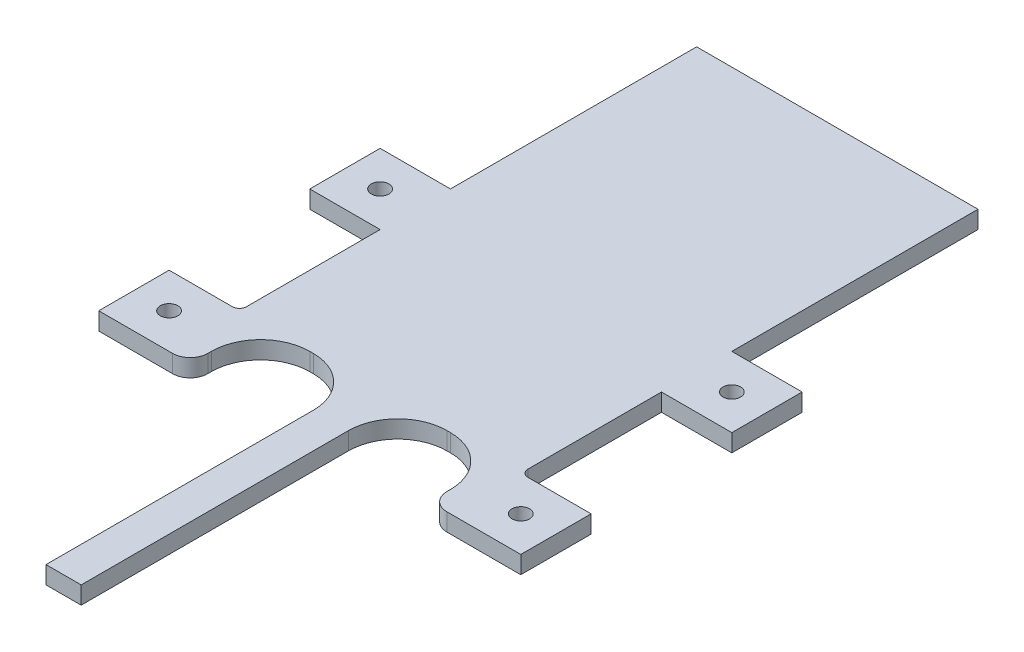
ISO-10303-21;
HEADER;
FILE_DESCRIPTION(('STEP AP214'),'2;1');
FILE_NAME('part.step','',(''),(''),'','','');
FILE_SCHEMA(('AUTOMOTIVE_DESIGN { 1 0 10303 214 1 1 1 1 }'));
ENDSEC;
DATA;
#1=APPLICATION_CONTEXT('core data for automotive mechanical design processes');
#2=APPLICATION_PROTOCOL_DEFINITION('international standard','automotive_design',2000,#1);
#3=PRODUCT_CONTEXT('',#1,'mechanical');
#4=PRODUCT('Part','Part','',(#3));
#5=PRODUCT_RELATED_PRODUCT_CATEGORY('part','',(#4));
#6=PRODUCT_DEFINITION_FORMATION('','',#4);
#7=PRODUCT_DEFINITION_CONTEXT('part definition',#1,'design');
#8=PRODUCT_DEFINITION('design','',#6,#7);
#9=PRODUCT_DEFINITION_SHAPE('','',#8);
#10=(LENGTH_UNIT() NAMED_UNIT(*) SI_UNIT(.MILLI.,.METRE.));
#11=(NAMED_UNIT(*) PLANE_ANGLE_UNIT() SI_UNIT($,.RADIAN.));
#12=(NAMED_UNIT(*) SI_UNIT($,.STERADIAN.) SOLID_ANGLE_UNIT());
#13=UNCERTAINTY_MEASURE_WITH_UNIT(LENGTH_MEASURE(1.E-05),#10,'distance_accuracy_value','');
#14=(GEOMETRIC_REPRESENTATION_CONTEXT(3) GLOBAL_UNCERTAINTY_ASSIGNED_CONTEXT((#13)) GLOBAL_UNIT_ASSIGNED_CONTEXT((#10,
#11,#12)) REPRESENTATION_CONTEXT('',''));
#15=CARTESIAN_POINT('',(0.,0.,0.));
#16=DIRECTION('',(0.,0.,1.));
#17=DIRECTION('',(1.,0.,0.));
#18=AXIS2_PLACEMENT_3D('',#15,#16,#17);
#19=CARTESIAN_POINT('',(50.8,3.175,0.));
#20=DIRECTION('',(-1.,0.,0.));
#21=DIRECTION('',(0.,0.,1.));
#22=AXIS2_PLACEMENT_3D('',#19,#20,#21);
#23=PLANE('',#22);
#24=DIRECTION('',(0.,0.,-1.));
#25=VECTOR('',#24,1.);
#26=CARTESIAN_POINT('',(50.8,3.175,0.));
#27=LINE('',#26,#25);
#28=CARTESIAN_POINT('',(50.8,3.175,-101.6));
#29=VERTEX_POINT('',#28);
#30=CARTESIAN_POINT('',(50.8,3.175,-146.05));
#31=VERTEX_POINT('',#30);
#32=EDGE_CURVE('E288',#29,#31,#27,.T.);
#33=ORIENTED_EDGE('',*,*,#32,.F.);
#34=DIRECTION('',(0.,1.,0.));
#35=VECTOR('',#34,1.);
#36=CARTESIAN_POINT('',(50.8,0.,-101.6));
#37=LINE('',#36,#35);
#38=CARTESIAN_POINT('',(50.8,0.,-101.6));
#39=VERTEX_POINT('',#38);
#40=EDGE_CURVE('E520',#39,#29,#37,.T.);
#41=ORIENTED_EDGE('',*,*,#40,.F.);
#42=DIRECTION('',(0.,0.,-1.));
#43=VECTOR('',#42,1.);
#44=CARTESIAN_POINT('',(50.8,0.,0.));
#45=LINE('',#44,#43);
#46=CARTESIAN_POINT('',(50.8,0.,-146.05));
#47=VERTEX_POINT('',#46);
#48=EDGE_CURVE('E295',#39,#47,#45,.T.);
#49=ORIENTED_EDGE('',*,*,#48,.T.);
#50=DIRECTION('',(0.,-1.,0.));
#51=VECTOR('',#50,1.);
#52=CARTESIAN_POINT('',(50.8,3.175,-146.05));
#53=LINE('',#52,#51);
#54=EDGE_CURVE('E478',#31,#47,#53,.T.);
#55=ORIENTED_EDGE('',*,*,#54,.F.);
#56=EDGE_LOOP('',(#33,#41,#49,#55));
#57=FACE_BOUND('',#56,.T.);
#58=ADVANCED_FACE('F33',(#57),#23,.F.);
#59=CARTESIAN_POINT('',(0.,3.175,0.));
#60=DIRECTION('',(-1.,0.,0.));
#61=DIRECTION('',(0.,0.,1.));
#62=AXIS2_PLACEMENT_3D('',#59,#60,#61);
#63=PLANE('',#62);
#64=DIRECTION('',(0.,0.,-1.));
#65=VECTOR('',#64,1.);
#66=CARTESIAN_POINT('',(0.,0.,0.));
#67=LINE('',#66,#65);
#68=CARTESIAN_POINT('',(0.,0.,-64.77));
#69=VERTEX_POINT('',#68);
#70=CARTESIAN_POINT('',(0.,0.,-88.9));
#71=VERTEX_POINT('',#70);
#72=EDGE_CURVE('E293',#69,#71,#67,.T.);
#73=ORIENTED_EDGE('',*,*,#72,.F.);
#74=DIRECTION('',(0.,1.,0.));
#75=VECTOR('',#74,1.);
#76=CARTESIAN_POINT('',(0.,3.175,-64.77));
#77=LINE('',#76,#75);
#78=CARTESIAN_POINT('',(0.,3.175,-64.77));
#79=VERTEX_POINT('',#78);
#80=EDGE_CURVE('E353',#69,#79,#77,.T.);
#81=ORIENTED_EDGE('',*,*,#80,.T.);
#82=DIRECTION('',(0.,0.,-1.));
#83=VECTOR('',#82,1.);
#84=CARTESIAN_POINT('',(0.,3.175,0.));
#85=LINE('',#84,#83);
#86=CARTESIAN_POINT('',(0.,3.175,-88.9));
#87=VERTEX_POINT('',#86);
#88=EDGE_CURVE('E286',#79,#87,#85,.T.);
#89=ORIENTED_EDGE('',*,*,#88,.T.);
#90=DIRECTION('',(0.,1.,0.));
#91=VECTOR('',#90,1.);
#92=CARTESIAN_POINT('',(0.,0.,-88.9));
#93=LINE('',#92,#91);
#94=EDGE_CURVE('E380',#71,#87,#93,.T.);
#95=ORIENTED_EDGE('',*,*,#94,.F.);
#96=EDGE_LOOP('',(#73,#81,#89,#95));
#97=FACE_BOUND('',#96,.T.);
#98=ADVANCED_FACE('F377',(#97),#63,.T.);
#99=CARTESIAN_POINT('',(50.8,3.175,-64.77));
#100=VERTEX_POINT('',#99);
#101=CARTESIAN_POINT('',(50.8,3.175,-88.9));
#102=VERTEX_POINT('',#101);
#103=EDGE_CURVE('E290',#100,#102,#27,.T.);
#104=ORIENTED_EDGE('',*,*,#103,.F.);
#105=DIRECTION('',(0.,1.,0.));
#106=VECTOR('',#105,1.);
#107=CARTESIAN_POINT('',(50.8,3.175,-64.77));
#108=LINE('',#107,#106);
#109=CARTESIAN_POINT('',(50.8,0.,-64.77));
#110=VERTEX_POINT('',#109);
#111=EDGE_CURVE('E54',#100,#110,#108,.F.);
#112=ORIENTED_EDGE('',*,*,#111,.T.);
#113=CARTESIAN_POINT('',(50.8,0.,-88.9));
#114=VERTEX_POINT('',#113);
#115=EDGE_CURVE('E287',#110,#114,#45,.T.);
#116=ORIENTED_EDGE('',*,*,#115,.T.);
#117=DIRECTION('',(0.,1.,0.));
#118=VECTOR('',#117,1.);
#119=CARTESIAN_POINT('',(50.8,0.,-88.9));
#120=LINE('',#119,#118);
#121=EDGE_CURVE('E523',#114,#102,#120,.T.);
#122=ORIENTED_EDGE('',*,*,#121,.T.);
#123=EDGE_LOOP('',(#104,#112,#116,#122));
#124=FACE_BOUND('',#123,.T.);
#125=ADVANCED_FACE('F580',(#124),#23,.F.);
#126=DIRECTION('',(0.,1.,0.));
#127=VECTOR('',#126,1.);
#128=CARTESIAN_POINT('',(0.,0.,-101.6));
#129=LINE('',#128,#127);
#130=CARTESIAN_POINT('',(0.,0.,-101.6));
#131=VERTEX_POINT('',#130);
#132=CARTESIAN_POINT('',(0.,3.175,-101.6));
#133=VERTEX_POINT('',#132);
#134=EDGE_CURVE('E492',#131,#133,#129,.T.);
#135=ORIENTED_EDGE('',*,*,#134,.T.);
#136=CARTESIAN_POINT('',(0.,3.175,-146.05));
#137=VERTEX_POINT('',#136);
#138=EDGE_CURVE('E284',#133,#137,#85,.T.);
#139=ORIENTED_EDGE('',*,*,#138,.T.);
#140=DIRECTION('',(0.,-1.,0.));
#141=VECTOR('',#140,1.);
#142=CARTESIAN_POINT('',(0.,3.175,-146.05));
#143=LINE('',#142,#141);
#144=CARTESIAN_POINT('',(0.,0.,-146.05));
#145=VERTEX_POINT('',#144);
#146=EDGE_CURVE('E481',#137,#145,#143,.T.);
#147=ORIENTED_EDGE('',*,*,#146,.T.);
#148=EDGE_CURVE('E291',#131,#145,#67,.T.);
#149=ORIENTED_EDGE('',*,*,#148,.F.);
#150=EDGE_LOOP('',(#135,#139,#147,#149));
#151=FACE_BOUND('',#150,.T.);
#152=ADVANCED_FACE('F584',(#151),#63,.T.);
#153=CARTESIAN_POINT('',(0.,3.175,0.));
#154=DIRECTION('',(0.,-1.,0.));
#155=DIRECTION('',(0.,0.,-1.));
#156=AXIS2_PLACEMENT_3D('',#153,#154,#155);
#157=PLANE('',#156);
#158=DIRECTION('',(0.,0.,-1.));
#159=VECTOR('',#158,1.);
#160=CARTESIAN_POINT('',(46.99,3.175,0.));
#161=LINE('',#160,#159);
#162=CARTESIAN_POINT('',(46.99,3.175,-53.975));
#163=VERTEX_POINT('',#162);
#164=CARTESIAN_POINT('',(46.99,3.175,-54.61));
#165=VERTEX_POINT('',#164);
#166=EDGE_CURVE('E273',#163,#165,#161,.T.);
#167=ORIENTED_EDGE('',*,*,#166,.F.);
#168=CARTESIAN_POINT('',(50.165,3.175,-53.975));
#169=DIRECTION('',(0.,-1.,0.));
#170=DIRECTION('',(0.,0.,-1.));
#171=AXIS2_PLACEMENT_3D('',#168,#169,#170);
#172=CIRCLE('',#171,3.175);
#173=CARTESIAN_POINT('',(50.165,3.175,-50.8));
#174=VERTEX_POINT('',#173);
#175=EDGE_CURVE('E340',#163,#174,#172,.F.);
#176=ORIENTED_EDGE('',*,*,#175,.T.);
#177=DIRECTION('',(1.,0.,0.));
#178=VECTOR('',#177,1.);
#179=CARTESIAN_POINT('',(50.8,3.175,-50.8));
#180=LINE('',#179,#178);
#181=CARTESIAN_POINT('',(63.5,3.175,-50.8));
#182=VERTEX_POINT('',#181);
#183=EDGE_CURVE('E466',#174,#182,#180,.T.);
#184=ORIENTED_EDGE('',*,*,#183,.T.);
#185=DIRECTION('',(0.,0.,-1.));
#186=VECTOR('',#185,1.);
#187=CARTESIAN_POINT('',(63.5,3.175,-63.5));
#188=LINE('',#187,#186);
#189=CARTESIAN_POINT('',(63.5,3.175,-63.5));
#190=VERTEX_POINT('',#189);
#191=EDGE_CURVE('E463',#182,#190,#188,.T.);
#192=ORIENTED_EDGE('',*,*,#191,.T.);
#193=DIRECTION('',(-1.,0.,0.));
#194=VECTOR('',#193,1.);
#195=CARTESIAN_POINT('',(50.8,3.175,-63.5));
#196=LINE('',#195,#194);
#197=CARTESIAN_POINT('',(52.07,3.175,-63.5));
#198=VERTEX_POINT('',#197);
#199=EDGE_CURVE('E460',#190,#198,#196,.T.);
#200=ORIENTED_EDGE('',*,*,#199,.T.);
#201=CARTESIAN_POINT('',(52.07,3.175,-64.77));
#202=DIRECTION('',(0.,-1.,0.));
#203=DIRECTION('',(0.,0.,-1.));
#204=AXIS2_PLACEMENT_3D('',#201,#202,#203);
#205=CIRCLE('',#204,1.27);
#206=EDGE_CURVE('E41',#198,#100,#205,.T.);
#207=ORIENTED_EDGE('',*,*,#206,.T.);
#208=ORIENTED_EDGE('',*,*,#103,.T.);
#209=DIRECTION('',(1.,0.,0.));
#210=VECTOR('',#209,1.);
#211=CARTESIAN_POINT('',(50.8,3.175,-88.9));
#212=LINE('',#211,#210);
#213=CARTESIAN_POINT('',(63.5,3.175,-88.9));
#214=VERTEX_POINT('',#213);
#215=EDGE_CURVE('E540',#102,#214,#212,.T.);
#216=ORIENTED_EDGE('',*,*,#215,.T.);
#217=DIRECTION('',(0.,0.,-1.));
#218=VECTOR('',#217,1.);
#219=CARTESIAN_POINT('',(63.5,3.175,-101.6));
#220=LINE('',#219,#218);
#221=CARTESIAN_POINT('',(63.5,3.175,-101.6));
#222=VERTEX_POINT('',#221);
#223=EDGE_CURVE('E537',#214,#222,#220,.T.);
#224=ORIENTED_EDGE('',*,*,#223,.T.);
#225=DIRECTION('',(-1.,0.,0.));
#226=VECTOR('',#225,1.);
#227=CARTESIAN_POINT('',(50.8,3.175,-101.6));
#228=LINE('',#227,#226);
#229=EDGE_CURVE('E533',#222,#29,#228,.T.);
#230=ORIENTED_EDGE('',*,*,#229,.T.);
#231=ORIENTED_EDGE('',*,*,#32,.T.);
#232=DIRECTION('',(1.,0.,0.));
#233=VECTOR('',#232,1.);
#234=CARTESIAN_POINT('',(0.,3.175,-146.05));
#235=LINE('',#234,#233);
#236=EDGE_CURVE('E484',#137,#31,#235,.T.);
#237=ORIENTED_EDGE('',*,*,#236,.F.);
#238=ORIENTED_EDGE('',*,*,#138,.F.);
#239=DIRECTION('',(-1.,0.,0.));
#240=VECTOR('',#239,1.);
#241=CARTESIAN_POINT('',(0.,3.175,-101.6));
#242=LINE('',#241,#240);
#243=CARTESIAN_POINT('',(-12.7,3.175,-101.6));
#244=VERTEX_POINT('',#243);
#245=EDGE_CURVE('E507',#133,#244,#242,.T.);
#246=ORIENTED_EDGE('',*,*,#245,.T.);
#247=DIRECTION('',(0.,0.,1.));
#248=VECTOR('',#247,1.);
#249=CARTESIAN_POINT('',(-12.7,3.175,-101.6));
#250=LINE('',#249,#248);
#251=CARTESIAN_POINT('',(-12.7,3.175,-88.9));
#252=VERTEX_POINT('',#251);
#253=EDGE_CURVE('E504',#244,#252,#250,.T.);
#254=ORIENTED_EDGE('',*,*,#253,.T.);
#255=DIRECTION('',(1.,0.,0.));
#256=VECTOR('',#255,1.);
#257=CARTESIAN_POINT('',(0.,3.175,-88.9));
#258=LINE('',#257,#256);
#259=EDGE_CURVE('E501',#252,#87,#258,.T.);
#260=ORIENTED_EDGE('',*,*,#259,.T.);
#261=ORIENTED_EDGE('',*,*,#88,.F.);
#262=CARTESIAN_POINT('',(-1.27,3.175,-64.77));
#263=DIRECTION('',(0.,-1.,0.));
#264=DIRECTION('',(0.,0.,-1.));
#265=AXIS2_PLACEMENT_3D('',#262,#263,#264);
#266=CIRCLE('',#265,1.27);
#267=CARTESIAN_POINT('',(-1.27,3.175,-63.5));
#268=VERTEX_POINT('',#267);
#269=EDGE_CURVE('E362',#79,#268,#266,.T.);
#270=ORIENTED_EDGE('',*,*,#269,.T.);
#271=DIRECTION('',(-1.,0.,0.));
#272=VECTOR('',#271,1.);
#273=CARTESIAN_POINT('',(0.,3.175,-63.5));
#274=LINE('',#273,#272);
#275=CARTESIAN_POINT('',(-12.7,3.175,-63.5));
#276=VERTEX_POINT('',#275);
#277=EDGE_CURVE('E387',#268,#276,#274,.T.);
#278=ORIENTED_EDGE('',*,*,#277,.T.);
#279=DIRECTION('',(0.,0.,1.));
#280=VECTOR('',#279,1.);
#281=CARTESIAN_POINT('',(-12.7,3.175,-63.5));
#282=LINE('',#281,#280);
#283=CARTESIAN_POINT('',(-12.7,3.175,-50.8));
#284=VERTEX_POINT('',#283);
#285=EDGE_CURVE('E395',#276,#284,#282,.T.);
#286=ORIENTED_EDGE('',*,*,#285,.T.);
#287=DIRECTION('',(1.,0.,0.));
#288=VECTOR('',#287,1.);
#289=CARTESIAN_POINT('',(0.,3.175,-50.8));
#290=LINE('',#289,#288);
#291=CARTESIAN_POINT('',(0.634999999999999,3.175,-50.8));
#292=VERTEX_POINT('',#291);
#293=EDGE_CURVE('E398',#284,#292,#290,.T.);
#294=ORIENTED_EDGE('',*,*,#293,.T.);
#295=CARTESIAN_POINT('',(0.634999999999999,3.175,-53.975));
#296=DIRECTION('',(0.,-1.,0.));
#297=DIRECTION('',(0.,0.,-1.));
#298=AXIS2_PLACEMENT_3D('',#295,#296,#297);
#299=CIRCLE('',#298,3.175);
#300=CARTESIAN_POINT('',(3.81,3.175,-53.975));
#301=VERTEX_POINT('',#300);
#302=EDGE_CURVE('E338',#292,#301,#299,.F.);
#303=ORIENTED_EDGE('',*,*,#302,.T.);
#304=DIRECTION('',(0.,0.,1.));
#305=VECTOR('',#304,1.);
#306=CARTESIAN_POINT('',(3.81,3.175,0.));
#307=LINE('',#306,#305);
#308=CARTESIAN_POINT('',(3.81,3.175,-54.61));
#309=VERTEX_POINT('',#308);
#310=EDGE_CURVE('E280',#309,#301,#307,.T.);
#311=ORIENTED_EDGE('',*,*,#310,.F.);
#312=CARTESIAN_POINT('',(12.7,3.175,-54.61));
#313=DIRECTION('',(0.,-1.,0.));
#314=DIRECTION('',(0.,0.,-1.));
#315=AXIS2_PLACEMENT_3D('',#312,#313,#314);
#316=CIRCLE('',#315,8.89);
#317=CARTESIAN_POINT('',(12.7,3.175,-63.5));
#318=VERTEX_POINT('',#317);
#319=EDGE_CURVE('E331',#309,#318,#316,.T.);
#320=ORIENTED_EDGE('',*,*,#319,.T.);
#321=DIRECTION('',(-1.,0.,0.));
#322=VECTOR('',#321,1.);
#323=CARTESIAN_POINT('',(3.81,3.175,-63.5));
#324=LINE('',#323,#322);
#325=CARTESIAN_POINT('',(13.335,3.175,-63.5));
#326=VERTEX_POINT('',#325);
#327=EDGE_CURVE('E276',#326,#318,#324,.T.);
#328=ORIENTED_EDGE('',*,*,#327,.F.);
#329=CARTESIAN_POINT('',(13.335,3.175,-54.61));
#330=DIRECTION('',(0.,-1.,0.));
#331=DIRECTION('',(0.,0.,-1.));
#332=AXIS2_PLACEMENT_3D('',#329,#330,#331);
#333=CIRCLE('',#332,8.89);
#334=CARTESIAN_POINT('',(22.225,3.175,-54.61));
#335=VERTEX_POINT('',#334);
#336=EDGE_CURVE('E318',#326,#335,#333,.T.);
#337=ORIENTED_EDGE('',*,*,#336,.T.);
#338=DIRECTION('',(0.,0.,-1.));
#339=VECTOR('',#338,1.);
#340=CARTESIAN_POINT('',(22.225,3.175,0.));
#341=LINE('',#340,#339);
#342=CARTESIAN_POINT('',(22.225,3.175,-6.35));
#343=VERTEX_POINT('',#342);
#344=EDGE_CURVE('E419',#343,#335,#341,.T.);
#345=ORIENTED_EDGE('',*,*,#344,.F.);
#346=DIRECTION('',(-1.,0.,0.));
#347=VECTOR('',#346,1.);
#348=CARTESIAN_POINT('',(22.225,3.175,-6.35));
#349=LINE('',#348,#347);
#350=CARTESIAN_POINT('',(28.575,3.175,-6.35));
#351=VERTEX_POINT('',#350);
#352=EDGE_CURVE('E249',#351,#343,#349,.T.);
#353=ORIENTED_EDGE('',*,*,#352,.F.);
#354=DIRECTION('',(0.,0.,1.));
#355=VECTOR('',#354,1.);
#356=CARTESIAN_POINT('',(28.575,3.175,0.));
#357=LINE('',#356,#355);
#358=CARTESIAN_POINT('',(28.575,3.175,-54.61));
#359=VERTEX_POINT('',#358);
#360=EDGE_CURVE('E259',#359,#351,#357,.T.);
#361=ORIENTED_EDGE('',*,*,#360,.F.);
#362=CARTESIAN_POINT('',(37.465,3.175,-54.61));
#363=DIRECTION('',(0.,-1.,0.));
#364=DIRECTION('',(0.,0.,-1.));
#365=AXIS2_PLACEMENT_3D('',#362,#363,#364);
#366=CIRCLE('',#365,8.89);
#367=CARTESIAN_POINT('',(37.465,3.175,-63.5));
#368=VERTEX_POINT('',#367);
#369=EDGE_CURVE('E328',#359,#368,#366,.T.);
#370=ORIENTED_EDGE('',*,*,#369,.T.);
#371=DIRECTION('',(-1.,0.,0.));
#372=VECTOR('',#371,1.);
#373=CARTESIAN_POINT('',(28.575,3.175,-63.5));
#374=LINE('',#373,#372);
#375=CARTESIAN_POINT('',(38.1,3.175,-63.5));
#376=VERTEX_POINT('',#375);
#377=EDGE_CURVE('E268',#376,#368,#374,.T.);
#378=ORIENTED_EDGE('',*,*,#377,.F.);
#379=CARTESIAN_POINT('',(38.1,3.175,-54.61));
#380=DIRECTION('',(0.,-1.,0.));
#381=DIRECTION('',(0.,0.,-1.));
#382=AXIS2_PLACEMENT_3D('',#379,#380,#381);
#383=CIRCLE('',#382,8.89);
#384=EDGE_CURVE('E323',#376,#165,#383,.T.);
#385=ORIENTED_EDGE('',*,*,#384,.T.);
#386=EDGE_LOOP('',(#167,#176,#184,#192,#200,#207,#208,#216,#224,#230,#231,#237,#238,#246,#254,
#260,#261,#270,#278,#286,#294,#303,#311,#320,#328,#337,#345,#353,#361,#370,#378,#385));
#387=FACE_BOUND('',#386,.T.);
#388=CARTESIAN_POINT('',(-6.35,3.175,-57.15));
#389=DIRECTION('',(0.,1.,0.));
#390=DIRECTION('',(0.,0.,1.));
#391=AXIS2_PLACEMENT_3D('',#388,#389,#390);
#392=CIRCLE('',#391,1.5875);
#393=CARTESIAN_POINT('',(-6.35,3.175,-55.5625));
#394=VERTEX_POINT('',#393);
#395=EDGE_CURVE('E401',#394,#394,#392,.T.);
#396=ORIENTED_EDGE('',*,*,#395,.F.);
#397=EDGE_LOOP('',(#396));
#398=FACE_BOUND('',#397,.T.);
#399=CARTESIAN_POINT('',(57.15,3.175,-57.15));
#400=DIRECTION('',(0.,1.,0.));
#401=DIRECTION('',(0.,0.,1.));
#402=AXIS2_PLACEMENT_3D('',#399,#400,#401);
#403=CIRCLE('',#402,1.5875);
#404=CARTESIAN_POINT('',(57.15,3.175,-55.5625));
#405=VERTEX_POINT('',#404);
#406=EDGE_CURVE('E475',#405,#405,#403,.T.);
#407=ORIENTED_EDGE('',*,*,#406,.F.);
#408=EDGE_LOOP('',(#407));
#409=FACE_BOUND('',#408,.T.);
#410=CARTESIAN_POINT('',(-6.35,3.175,-95.25));
#411=DIRECTION('',(0.,1.,0.));
#412=DIRECTION('',(0.,0.,1.));
#413=AXIS2_PLACEMENT_3D('',#410,#411,#412);
#414=CIRCLE('',#413,1.5875);
#415=CARTESIAN_POINT('',(-6.35,3.175,-93.6625));
#416=VERTEX_POINT('',#415);
#417=EDGE_CURVE('E517',#416,#416,#414,.T.);
#418=ORIENTED_EDGE('',*,*,#417,.F.);
#419=EDGE_LOOP('',(#418));
#420=FACE_BOUND('',#419,.T.);
#421=CARTESIAN_POINT('',(57.15,3.175,-95.25));
#422=DIRECTION('',(0.,1.,0.));
#423=DIRECTION('',(0.,0.,1.));
#424=AXIS2_PLACEMENT_3D('',#421,#422,#423);
#425=CIRCLE('',#424,1.5875);
#426=CARTESIAN_POINT('',(57.15,3.175,-93.6625));
#427=VERTEX_POINT('',#426);
#428=EDGE_CURVE('E551',#427,#427,#425,.T.);
#429=ORIENTED_EDGE('',*,*,#428,.F.);
#430=EDGE_LOOP('',(#429));
#431=FACE_BOUND('',#430,.T.);
#432=ADVANCED_FACE('F384',(#387,#398,#409,#420,#431),#157,.F.);
#433=CARTESIAN_POINT('',(0.,0.,0.));
#434=DIRECTION('',(0.,-1.,0.));
#435=DIRECTION('',(0.,0.,-1.));
#436=AXIS2_PLACEMENT_3D('',#433,#434,#435);
#437=PLANE('',#436);
#438=DIRECTION('',(1.,0.,0.));
#439=VECTOR('',#438,1.);
#440=CARTESIAN_POINT('',(50.8,0.,-50.8));
#441=LINE('',#440,#439);
#442=CARTESIAN_POINT('',(50.165,0.,-50.8));
#443=VERTEX_POINT('',#442);
#444=CARTESIAN_POINT('',(63.5,0.,-50.8));
#445=VERTEX_POINT('',#444);
#446=EDGE_CURVE('E462',#443,#445,#441,.T.);
#447=ORIENTED_EDGE('',*,*,#446,.F.);
#448=CARTESIAN_POINT('',(50.165,0.,-53.975));
#449=DIRECTION('',(0.,-1.,0.));
#450=DIRECTION('',(0.,0.,-1.));
#451=AXIS2_PLACEMENT_3D('',#448,#449,#450);
#452=CIRCLE('',#451,3.175);
#453=CARTESIAN_POINT('',(46.99,0.,-53.975));
#454=VERTEX_POINT('',#453);
#455=EDGE_CURVE('E346',#443,#454,#452,.T.);
#456=ORIENTED_EDGE('',*,*,#455,.T.);
#457=DIRECTION('',(0.,0.,-1.));
#458=VECTOR('',#457,1.);
#459=CARTESIAN_POINT('',(46.99,0.,0.));
#460=LINE('',#459,#458);
#461=CARTESIAN_POINT('',(46.99,0.,-54.61));
#462=VERTEX_POINT('',#461);
#463=EDGE_CURVE('E267',#454,#462,#460,.T.);
#464=ORIENTED_EDGE('',*,*,#463,.T.);
#465=CARTESIAN_POINT('',(38.1,0.,-54.61));
#466=DIRECTION('',(0.,-1.,0.));
#467=DIRECTION('',(0.,0.,-1.));
#468=AXIS2_PLACEMENT_3D('',#465,#466,#467);
#469=CIRCLE('',#468,8.89);
#470=CARTESIAN_POINT('',(38.1,0.,-63.5));
#471=VERTEX_POINT('',#470);
#472=EDGE_CURVE('E326',#462,#471,#469,.F.);
#473=ORIENTED_EDGE('',*,*,#472,.T.);
#474=DIRECTION('',(-1.,0.,0.));
#475=VECTOR('',#474,1.);
#476=CARTESIAN_POINT('',(28.575,0.,-63.5));
#477=LINE('',#476,#475);
#478=CARTESIAN_POINT('',(37.465,0.,-63.5));
#479=VERTEX_POINT('',#478);
#480=EDGE_CURVE('E270',#471,#479,#477,.T.);
#481=ORIENTED_EDGE('',*,*,#480,.T.);
#482=CARTESIAN_POINT('',(37.465,0.,-54.61));
#483=DIRECTION('',(0.,-1.,0.));
#484=DIRECTION('',(0.,0.,-1.));
#485=AXIS2_PLACEMENT_3D('',#482,#483,#484);
#486=CIRCLE('',#485,8.89);
#487=CARTESIAN_POINT('',(28.575,0.,-54.61));
#488=VERTEX_POINT('',#487);
#489=EDGE_CURVE('E266',#479,#488,#486,.F.);
#490=ORIENTED_EDGE('',*,*,#489,.T.);
#491=DIRECTION('',(0.,0.,1.));
#492=VECTOR('',#491,1.);
#493=CARTESIAN_POINT('',(28.575,0.,0.));
#494=LINE('',#493,#492);
#495=CARTESIAN_POINT('',(28.575,0.,-6.35));
#496=VERTEX_POINT('',#495);
#497=EDGE_CURVE('E256',#488,#496,#494,.T.);
#498=ORIENTED_EDGE('',*,*,#497,.T.);
#499=DIRECTION('',(-1.,0.,0.));
#500=VECTOR('',#499,1.);
#501=CARTESIAN_POINT('',(22.225,0.,-6.35));
#502=LINE('',#501,#500);
#503=CARTESIAN_POINT('',(22.225,0.,-6.35));
#504=VERTEX_POINT('',#503);
#505=EDGE_CURVE('E239',#496,#504,#502,.T.);
#506=ORIENTED_EDGE('',*,*,#505,.T.);
#507=DIRECTION('',(0.,0.,-1.));
#508=VECTOR('',#507,1.);
#509=CARTESIAN_POINT('',(22.225,0.,0.));
#510=LINE('',#509,#508);
#511=CARTESIAN_POINT('',(22.225,0.,-54.61));
#512=VERTEX_POINT('',#511);
#513=EDGE_CURVE('E414',#504,#512,#510,.T.);
#514=ORIENTED_EDGE('',*,*,#513,.T.);
#515=CARTESIAN_POINT('',(13.335,0.,-54.61));
#516=DIRECTION('',(0.,-1.,0.));
#517=DIRECTION('',(0.,0.,-1.));
#518=AXIS2_PLACEMENT_3D('',#515,#516,#517);
#519=CIRCLE('',#518,8.89);
#520=CARTESIAN_POINT('',(13.335,0.,-63.5));
#521=VERTEX_POINT('',#520);
#522=EDGE_CURVE('E321',#512,#521,#519,.F.);
#523=ORIENTED_EDGE('',*,*,#522,.T.);
#524=DIRECTION('',(-1.,0.,0.));
#525=VECTOR('',#524,1.);
#526=CARTESIAN_POINT('',(3.81,0.,-63.5));
#527=LINE('',#526,#525);
#528=CARTESIAN_POINT('',(12.7,0.,-63.5));
#529=VERTEX_POINT('',#528);
#530=EDGE_CURVE('E294',#521,#529,#527,.T.);
#531=ORIENTED_EDGE('',*,*,#530,.T.);
#532=CARTESIAN_POINT('',(12.7,0.,-54.61));
#533=DIRECTION('',(0.,-1.,0.));
#534=DIRECTION('',(0.,0.,-1.));
#535=AXIS2_PLACEMENT_3D('',#532,#533,#534);
#536=CIRCLE('',#535,8.89);
#537=CARTESIAN_POINT('',(3.81,0.,-54.61));
#538=VERTEX_POINT('',#537);
#539=EDGE_CURVE('E333',#529,#538,#536,.F.);
#540=ORIENTED_EDGE('',*,*,#539,.T.);
#541=DIRECTION('',(0.,0.,1.));
#542=VECTOR('',#541,1.);
#543=CARTESIAN_POINT('',(3.81,0.,0.));
#544=LINE('',#543,#542);
#545=CARTESIAN_POINT('',(3.81,0.,-53.975));
#546=VERTEX_POINT('',#545);
#547=EDGE_CURVE('E411',#538,#546,#544,.T.);
#548=ORIENTED_EDGE('',*,*,#547,.T.);
#549=CARTESIAN_POINT('',(0.634999999999999,0.,-53.975));
#550=DIRECTION('',(0.,-1.,0.));
#551=DIRECTION('',(0.,0.,-1.));
#552=AXIS2_PLACEMENT_3D('',#549,#550,#551);
#553=CIRCLE('',#552,3.175);
#554=CARTESIAN_POINT('',(0.634999999999999,0.,-50.8));
#555=VERTEX_POINT('',#554);
#556=EDGE_CURVE('E344',#546,#555,#553,.T.);
#557=ORIENTED_EDGE('',*,*,#556,.T.);
#558=DIRECTION('',(1.,0.,0.));
#559=VECTOR('',#558,1.);
#560=CARTESIAN_POINT('',(0.,0.,-50.8));
#561=LINE('',#560,#559);
#562=CARTESIAN_POINT('',(-12.7,0.,-50.8));
#563=VERTEX_POINT('',#562);
#564=EDGE_CURVE('E404',#563,#555,#561,.T.);
#565=ORIENTED_EDGE('',*,*,#564,.F.);
#566=DIRECTION('',(0.,0.,1.));
#567=VECTOR('',#566,1.);
#568=CARTESIAN_POINT('',(-12.7,0.,-63.5));
#569=LINE('',#568,#567);
#570=CARTESIAN_POINT('',(-12.7,0.,-63.5));
#571=VERTEX_POINT('',#570);
#572=EDGE_CURVE('E448',#571,#563,#569,.T.);
#573=ORIENTED_EDGE('',*,*,#572,.F.);
#574=DIRECTION('',(-1.,0.,0.));
#575=VECTOR('',#574,1.);
#576=CARTESIAN_POINT('',(0.,0.,-63.5));
#577=LINE('',#576,#575);
#578=CARTESIAN_POINT('',(-1.27,0.,-63.5));
#579=VERTEX_POINT('',#578);
#580=EDGE_CURVE('E371',#579,#571,#577,.T.);
#581=ORIENTED_EDGE('',*,*,#580,.F.);
#582=CARTESIAN_POINT('',(-1.27,0.,-64.77));
#583=DIRECTION('',(0.,-1.,0.));
#584=DIRECTION('',(0.,0.,-1.));
#585=AXIS2_PLACEMENT_3D('',#582,#583,#584);
#586=CIRCLE('',#585,1.27);
#587=EDGE_CURVE('E364',#579,#69,#586,.F.);
#588=ORIENTED_EDGE('',*,*,#587,.T.);
#589=ORIENTED_EDGE('',*,*,#72,.T.);
#590=DIRECTION('',(1.,0.,0.));
#591=VECTOR('',#590,1.);
#592=CARTESIAN_POINT('',(0.,0.,-88.9));
#593=LINE('',#592,#591);
#594=CARTESIAN_POINT('',(-12.7,0.,-88.9));
#595=VERTEX_POINT('',#594);
#596=EDGE_CURVE('E496',#595,#71,#593,.T.);
#597=ORIENTED_EDGE('',*,*,#596,.F.);
#598=DIRECTION('',(0.,0.,1.));
#599=VECTOR('',#598,1.);
#600=CARTESIAN_POINT('',(-12.7,0.,-101.6));
#601=LINE('',#600,#599);
#602=CARTESIAN_POINT('',(-12.7,0.,-101.6));
#603=VERTEX_POINT('',#602);
#604=EDGE_CURVE('E512',#603,#595,#601,.T.);
#605=ORIENTED_EDGE('',*,*,#604,.F.);
#606=DIRECTION('',(-1.,0.,0.));
#607=VECTOR('',#606,1.);
#608=CARTESIAN_POINT('',(0.,0.,-101.6));
#609=LINE('',#608,#607);
#610=EDGE_CURVE('E503',#131,#603,#609,.T.);
#611=ORIENTED_EDGE('',*,*,#610,.F.);
#612=ORIENTED_EDGE('',*,*,#148,.T.);
#613=DIRECTION('',(1.,0.,0.));
#614=VECTOR('',#613,1.);
#615=CARTESIAN_POINT('',(0.,0.,-146.05));
#616=LINE('',#615,#614);
#617=EDGE_CURVE('E487',#145,#47,#616,.T.);
#618=ORIENTED_EDGE('',*,*,#617,.T.);
#619=ORIENTED_EDGE('',*,*,#48,.F.);
#620=DIRECTION('',(-1.,0.,0.));
#621=VECTOR('',#620,1.);
#622=CARTESIAN_POINT('',(50.8,0.,-101.6));
#623=LINE('',#622,#621);
#624=CARTESIAN_POINT('',(63.5,0.,-101.6));
#625=VERTEX_POINT('',#624);
#626=EDGE_CURVE('E527',#625,#39,#623,.T.);
#627=ORIENTED_EDGE('',*,*,#626,.F.);
#628=DIRECTION('',(0.,0.,-1.));
#629=VECTOR('',#628,1.);
#630=CARTESIAN_POINT('',(63.5,0.,-101.6));
#631=LINE('',#630,#629);
#632=CARTESIAN_POINT('',(63.5,0.,-88.9));
#633=VERTEX_POINT('',#632);
#634=EDGE_CURVE('E546',#633,#625,#631,.T.);
#635=ORIENTED_EDGE('',*,*,#634,.F.);
#636=DIRECTION('',(1.,0.,0.));
#637=VECTOR('',#636,1.);
#638=CARTESIAN_POINT('',(50.8,0.,-88.9));
#639=LINE('',#638,#637);
#640=EDGE_CURVE('E536',#114,#633,#639,.T.);
#641=ORIENTED_EDGE('',*,*,#640,.F.);
#642=ORIENTED_EDGE('',*,*,#115,.F.);
#643=CARTESIAN_POINT('',(52.07,0.,-64.77));
#644=DIRECTION('',(0.,-1.,0.));
#645=DIRECTION('',(0.,0.,-1.));
#646=AXIS2_PLACEMENT_3D('',#643,#644,#645);
#647=CIRCLE('',#646,1.27);
#648=CARTESIAN_POINT('',(52.07,0.,-63.5));
#649=VERTEX_POINT('',#648);
#650=EDGE_CURVE('E11',#110,#649,#647,.F.);
#651=ORIENTED_EDGE('',*,*,#650,.T.);
#652=DIRECTION('',(-1.,0.,0.));
#653=VECTOR('',#652,1.);
#654=CARTESIAN_POINT('',(50.8,0.,-63.5));
#655=LINE('',#654,#653);
#656=CARTESIAN_POINT('',(63.5,0.,-63.5));
#657=VERTEX_POINT('',#656);
#658=EDGE_CURVE('E458',#657,#649,#655,.T.);
#659=ORIENTED_EDGE('',*,*,#658,.F.);
#660=DIRECTION('',(0.,0.,-1.));
#661=VECTOR('',#660,1.);
#662=CARTESIAN_POINT('',(63.5,0.,-63.5));
#663=LINE('',#662,#661);
#664=EDGE_CURVE('E471',#445,#657,#663,.T.);
#665=ORIENTED_EDGE('',*,*,#664,.F.);
#666=EDGE_LOOP('',(#447,#456,#464,#473,#481,#490,#498,#506,#514,#523,#531,#540,#548,#557,#565,
#573,#581,#588,#589,#597,#605,#611,#612,#618,#619,#627,#635,#641,#642,#651,#659,#665));
#667=FACE_BOUND('',#666,.T.);
#668=CARTESIAN_POINT('',(-6.35,0.,-57.15));
#669=DIRECTION('',(0.,1.,0.));
#670=DIRECTION('',(0.,0.,1.));
#671=AXIS2_PLACEMENT_3D('',#668,#669,#670);
#672=CIRCLE('',#671,1.5875);
#673=CARTESIAN_POINT('',(-6.35,0.,-55.5625));
#674=VERTEX_POINT('',#673);
#675=EDGE_CURVE('E396',#674,#674,#672,.T.);
#676=ORIENTED_EDGE('',*,*,#675,.T.);
#677=EDGE_LOOP('',(#676));
#678=FACE_BOUND('',#677,.T.);
#679=CARTESIAN_POINT('',(57.15,0.,-57.15));
#680=DIRECTION('',(0.,1.,0.));
#681=DIRECTION('',(0.,0.,1.));
#682=AXIS2_PLACEMENT_3D('',#679,#680,#681);
#683=CIRCLE('',#682,1.5875);
#684=CARTESIAN_POINT('',(57.15,0.,-55.5625));
#685=VERTEX_POINT('',#684);
#686=EDGE_CURVE('E468',#685,#685,#683,.T.);
#687=ORIENTED_EDGE('',*,*,#686,.T.);
#688=EDGE_LOOP('',(#687));
#689=FACE_BOUND('',#688,.T.);
#690=CARTESIAN_POINT('',(-6.35,0.,-95.25));
#691=DIRECTION('',(0.,1.,0.));
#692=DIRECTION('',(0.,0.,1.));
#693=AXIS2_PLACEMENT_3D('',#690,#691,#692);
#694=CIRCLE('',#693,1.5875);
#695=CARTESIAN_POINT('',(-6.35,0.,-93.6625));
#696=VERTEX_POINT('',#695);
#697=EDGE_CURVE('E510',#696,#696,#694,.T.);
#698=ORIENTED_EDGE('',*,*,#697,.T.);
#699=EDGE_LOOP('',(#698));
#700=FACE_BOUND('',#699,.T.);
#701=CARTESIAN_POINT('',(57.15,0.,-95.25));
#702=DIRECTION('',(0.,1.,0.));
#703=DIRECTION('',(0.,0.,1.));
#704=AXIS2_PLACEMENT_3D('',#701,#702,#703);
#705=CIRCLE('',#704,1.5875);
#706=CARTESIAN_POINT('',(57.15,0.,-93.6625));
#707=VERTEX_POINT('',#706);
#708=EDGE_CURVE('E543',#707,#707,#705,.T.);
#709=ORIENTED_EDGE('',*,*,#708,.T.);
#710=EDGE_LOOP('',(#709));
#711=FACE_BOUND('',#710,.T.);
#712=ADVANCED_FACE('F262',(#667,#678,#689,#700,#711),#437,.T.);
#713=CARTESIAN_POINT('',(28.575,0.,0.));
#714=DIRECTION('',(-1.,0.,0.));
#715=DIRECTION('',(0.,0.,1.));
#716=AXIS2_PLACEMENT_3D('',#713,#714,#715);
#717=PLANE('',#716);
#718=ORIENTED_EDGE('',*,*,#360,.T.);
#719=DIRECTION('',(0.,1.,0.));
#720=VECTOR('',#719,1.);
#721=CARTESIAN_POINT('',(28.575,0.,-6.35));
#722=LINE('',#721,#720);
#723=EDGE_CURVE('E242',#496,#351,#722,.T.);
#724=ORIENTED_EDGE('',*,*,#723,.F.);
#725=ORIENTED_EDGE('',*,*,#497,.F.);
#726=DIRECTION('',(0.,1.,0.));
#727=VECTOR('',#726,1.);
#728=CARTESIAN_POINT('',(28.575,3.175,-54.61));
#729=LINE('',#728,#727);
#730=EDGE_CURVE('E313',#488,#359,#729,.T.);
#731=ORIENTED_EDGE('',*,*,#730,.T.);
#732=EDGE_LOOP('',(#718,#724,#725,#731));
#733=FACE_BOUND('',#732,.T.);
#734=ADVANCED_FACE('F254',(#733),#717,.F.);
#735=CARTESIAN_POINT('',(28.575,0.,-63.5));
#736=DIRECTION('',(0.,0.,-1.));
#737=DIRECTION('',(-1.,0.,0.));
#738=AXIS2_PLACEMENT_3D('',#735,#736,#737);
#739=PLANE('',#738);
#740=ORIENTED_EDGE('',*,*,#480,.F.);
#741=DIRECTION('',(0.,1.,0.));
#742=VECTOR('',#741,1.);
#743=CARTESIAN_POINT('',(38.1,3.175,-63.5));
#744=LINE('',#743,#742);
#745=EDGE_CURVE('E307',#471,#376,#744,.T.);
#746=ORIENTED_EDGE('',*,*,#745,.T.);
#747=ORIENTED_EDGE('',*,*,#377,.T.);
#748=DIRECTION('',(0.,1.,0.));
#749=VECTOR('',#748,1.);
#750=CARTESIAN_POINT('',(37.465,0.,-63.5));
#751=LINE('',#750,#749);
#752=EDGE_CURVE('E305',#368,#479,#751,.F.);
#753=ORIENTED_EDGE('',*,*,#752,.T.);
#754=EDGE_LOOP('',(#740,#746,#747,#753));
#755=FACE_BOUND('',#754,.T.);
#756=ADVANCED_FACE('F622',(#755),#739,.F.);
#757=CARTESIAN_POINT('',(46.99,0.,0.));
#758=DIRECTION('',(1.,0.,0.));
#759=DIRECTION('',(0.,0.,-1.));
#760=AXIS2_PLACEMENT_3D('',#757,#758,#759);
#761=PLANE('',#760);
#762=ORIENTED_EDGE('',*,*,#463,.F.);
#763=DIRECTION('',(0.,1.,0.));
#764=VECTOR('',#763,1.);
#765=CARTESIAN_POINT('',(46.99,3.175,-53.975));
#766=LINE('',#765,#764);
#767=EDGE_CURVE('E335',#454,#163,#766,.T.);
#768=ORIENTED_EDGE('',*,*,#767,.T.);
#769=ORIENTED_EDGE('',*,*,#166,.T.);
#770=DIRECTION('',(0.,1.,0.));
#771=VECTOR('',#770,1.);
#772=CARTESIAN_POINT('',(46.99,0.,-54.61));
#773=LINE('',#772,#771);
#774=EDGE_CURVE('E310',#165,#462,#773,.F.);
#775=ORIENTED_EDGE('',*,*,#774,.T.);
#776=EDGE_LOOP('',(#762,#768,#769,#775));
#777=FACE_BOUND('',#776,.T.);
#778=ADVANCED_FACE('F614',(#777),#761,.F.);
#779=CARTESIAN_POINT('',(3.81,0.,0.));
#780=DIRECTION('',(-1.,0.,0.));
#781=DIRECTION('',(0.,0.,1.));
#782=AXIS2_PLACEMENT_3D('',#779,#780,#781);
#783=PLANE('',#782);
#784=ORIENTED_EDGE('',*,*,#310,.T.);
#785=DIRECTION('',(0.,1.,0.));
#786=VECTOR('',#785,1.);
#787=CARTESIAN_POINT('',(3.81,0.,-53.975));
#788=LINE('',#787,#786);
#789=EDGE_CURVE('E351',#301,#546,#788,.F.);
#790=ORIENTED_EDGE('',*,*,#789,.T.);
#791=ORIENTED_EDGE('',*,*,#547,.F.);
#792=DIRECTION('',(0.,1.,0.));
#793=VECTOR('',#792,1.);
#794=CARTESIAN_POINT('',(3.81,3.175,-54.61));
#795=LINE('',#794,#793);
#796=EDGE_CURVE('E315',#538,#309,#795,.T.);
#797=ORIENTED_EDGE('',*,*,#796,.T.);
#798=EDGE_LOOP('',(#784,#790,#791,#797));
#799=FACE_BOUND('',#798,.T.);
#800=ADVANCED_FACE('F436',(#799),#783,.F.);
#801=CARTESIAN_POINT('',(3.81,0.,-63.5));
#802=DIRECTION('',(0.,0.,-1.));
#803=DIRECTION('',(-1.,0.,0.));
#804=AXIS2_PLACEMENT_3D('',#801,#802,#803);
#805=PLANE('',#804);
#806=ORIENTED_EDGE('',*,*,#530,.F.);
#807=DIRECTION('',(0.,1.,0.));
#808=VECTOR('',#807,1.);
#809=CARTESIAN_POINT('',(13.335,3.175,-63.5));
#810=LINE('',#809,#808);
#811=EDGE_CURVE('E299',#521,#326,#810,.T.);
#812=ORIENTED_EDGE('',*,*,#811,.T.);
#813=ORIENTED_EDGE('',*,*,#327,.T.);
#814=DIRECTION('',(0.,1.,0.));
#815=VECTOR('',#814,1.);
#816=CARTESIAN_POINT('',(12.7,0.,-63.5));
#817=LINE('',#816,#815);
#818=EDGE_CURVE('E297',#318,#529,#817,.F.);
#819=ORIENTED_EDGE('',*,*,#818,.T.);
#820=EDGE_LOOP('',(#806,#812,#813,#819));
#821=FACE_BOUND('',#820,.T.);
#822=ADVANCED_FACE('F427',(#821),#805,.F.);
#823=CARTESIAN_POINT('',(22.225,0.,0.));
#824=DIRECTION('',(1.,0.,0.));
#825=DIRECTION('',(0.,0.,-1.));
#826=AXIS2_PLACEMENT_3D('',#823,#824,#825);
#827=PLANE('',#826);
#828=ORIENTED_EDGE('',*,*,#513,.F.);
#829=DIRECTION('',(0.,1.,0.));
#830=VECTOR('',#829,1.);
#831=CARTESIAN_POINT('',(22.225,0.,-6.35));
#832=LINE('',#831,#830);
#833=EDGE_CURVE('E245',#504,#343,#832,.T.);
#834=ORIENTED_EDGE('',*,*,#833,.T.);
#835=ORIENTED_EDGE('',*,*,#344,.T.);
#836=DIRECTION('',(0.,1.,0.));
#837=VECTOR('',#836,1.);
#838=CARTESIAN_POINT('',(22.225,0.,-54.61));
#839=LINE('',#838,#837);
#840=EDGE_CURVE('E302',#335,#512,#839,.F.);
#841=ORIENTED_EDGE('',*,*,#840,.T.);
#842=EDGE_LOOP('',(#828,#834,#835,#841));
#843=FACE_BOUND('',#842,.T.);
#844=ADVANCED_FACE('F557',(#843),#827,.F.);
#845=CARTESIAN_POINT('',(0.,0.,-50.8));
#846=DIRECTION('',(0.,0.,1.));
#847=DIRECTION('',(1.,0.,0.));
#848=AXIS2_PLACEMENT_3D('',#845,#846,#847);
#849=PLANE('',#848);
#850=ORIENTED_EDGE('',*,*,#564,.T.);
#851=DIRECTION('',(0.,1.,0.));
#852=VECTOR('',#851,1.);
#853=CARTESIAN_POINT('',(0.634999999999999,3.175,-50.8));
#854=LINE('',#853,#852);
#855=EDGE_CURVE('E348',#555,#292,#854,.T.);
#856=ORIENTED_EDGE('',*,*,#855,.T.);
#857=ORIENTED_EDGE('',*,*,#293,.F.);
#858=DIRECTION('',(0.,1.,0.));
#859=VECTOR('',#858,1.);
#860=CARTESIAN_POINT('',(-12.7,0.,-50.8));
#861=LINE('',#860,#859);
#862=EDGE_CURVE('E282',#563,#284,#861,.T.);
#863=ORIENTED_EDGE('',*,*,#862,.F.);
#864=EDGE_LOOP('',(#850,#856,#857,#863));
#865=FACE_BOUND('',#864,.T.);
#866=ADVANCED_FACE('F445',(#865),#849,.T.);
#867=CARTESIAN_POINT('',(-12.7,0.,-63.5));
#868=DIRECTION('',(-1.,0.,0.));
#869=DIRECTION('',(0.,0.,1.));
#870=AXIS2_PLACEMENT_3D('',#867,#868,#869);
#871=PLANE('',#870);
#872=ORIENTED_EDGE('',*,*,#285,.F.);
#873=DIRECTION('',(0.,1.,0.));
#874=VECTOR('',#873,1.);
#875=CARTESIAN_POINT('',(-12.7,0.,-63.5));
#876=LINE('',#875,#874);
#877=EDGE_CURVE('E393',#571,#276,#876,.T.);
#878=ORIENTED_EDGE('',*,*,#877,.F.);
#879=ORIENTED_EDGE('',*,*,#572,.T.);
#880=ORIENTED_EDGE('',*,*,#862,.T.);
#881=EDGE_LOOP('',(#872,#878,#879,#880));
#882=FACE_BOUND('',#881,.T.);
#883=ADVANCED_FACE('F668',(#882),#871,.T.);
#884=CARTESIAN_POINT('',(0.,0.,-63.5));
#885=DIRECTION('',(0.,0.,-1.));
#886=DIRECTION('',(-1.,0.,0.));
#887=AXIS2_PLACEMENT_3D('',#884,#885,#886);
#888=PLANE('',#887);
#889=ORIENTED_EDGE('',*,*,#277,.F.);
#890=DIRECTION('',(0.,1.,0.));
#891=VECTOR('',#890,1.);
#892=CARTESIAN_POINT('',(-1.27,0.,-63.5));
#893=LINE('',#892,#891);
#894=EDGE_CURVE('E356',#268,#579,#893,.F.);
#895=ORIENTED_EDGE('',*,*,#894,.T.);
#896=ORIENTED_EDGE('',*,*,#580,.T.);
#897=ORIENTED_EDGE('',*,*,#877,.T.);
#898=EDGE_LOOP('',(#889,#895,#896,#897));
#899=FACE_BOUND('',#898,.T.);
#900=ADVANCED_FACE('F391',(#899),#888,.T.);
#901=CARTESIAN_POINT('',(-6.35,0.,-57.15));
#902=DIRECTION('',(0.,1.,0.));
#903=DIRECTION('',(0.,0.,1.));
#904=AXIS2_PLACEMENT_3D('',#901,#902,#903);
#905=CYLINDRICAL_SURFACE('',#904,1.5875);
#906=ORIENTED_EDGE('',*,*,#675,.F.);
#907=EDGE_LOOP('',(#906));
#908=FACE_BOUND('',#907,.T.);
#909=ORIENTED_EDGE('',*,*,#395,.T.);
#910=EDGE_LOOP('',(#909));
#911=FACE_BOUND('',#910,.T.);
#912=ADVANCED_FACE('F655',(#908,#911),#905,.F.);
#913=CARTESIAN_POINT('',(50.8,0.,-63.5));
#914=DIRECTION('',(0.,0.,-1.));
#915=DIRECTION('',(-1.,0.,0.));
#916=AXIS2_PLACEMENT_3D('',#913,#914,#915);
#917=PLANE('',#916);
#918=ORIENTED_EDGE('',*,*,#658,.T.);
#919=DIRECTION('',(0.,1.,0.));
#920=VECTOR('',#919,1.);
#921=CARTESIAN_POINT('',(52.07,0.,-63.5));
#922=LINE('',#921,#920);
#923=EDGE_CURVE('E358',#649,#198,#922,.T.);
#924=ORIENTED_EDGE('',*,*,#923,.T.);
#925=ORIENTED_EDGE('',*,*,#199,.F.);
#926=DIRECTION('',(0.,1.,0.));
#927=VECTOR('',#926,1.);
#928=CARTESIAN_POINT('',(63.5,0.,-63.5));
#929=LINE('',#928,#927);
#930=EDGE_CURVE('E453',#657,#190,#929,.T.);
#931=ORIENTED_EDGE('',*,*,#930,.F.);
#932=EDGE_LOOP('',(#918,#924,#925,#931));
#933=FACE_BOUND('',#932,.T.);
#934=ADVANCED_FACE('F600',(#933),#917,.T.);
#935=CARTESIAN_POINT('',(63.5,0.,-63.5));
#936=DIRECTION('',(1.,0.,0.));
#937=DIRECTION('',(0.,0.,-1.));
#938=AXIS2_PLACEMENT_3D('',#935,#936,#937);
#939=PLANE('',#938);
#940=ORIENTED_EDGE('',*,*,#191,.F.);
#941=DIRECTION('',(0.,1.,0.));
#942=VECTOR('',#941,1.);
#943=CARTESIAN_POINT('',(63.5,0.,-50.8));
#944=LINE('',#943,#942);
#945=EDGE_CURVE('E455',#445,#182,#944,.T.);
#946=ORIENTED_EDGE('',*,*,#945,.F.);
#947=ORIENTED_EDGE('',*,*,#664,.T.);
#948=ORIENTED_EDGE('',*,*,#930,.T.);
#949=EDGE_LOOP('',(#940,#946,#947,#948));
#950=FACE_BOUND('',#949,.T.);
#951=ADVANCED_FACE('F605',(#950),#939,.T.);
#952=CARTESIAN_POINT('',(50.8,0.,-50.8));
#953=DIRECTION('',(0.,0.,1.));
#954=DIRECTION('',(1.,0.,0.));
#955=AXIS2_PLACEMENT_3D('',#952,#953,#954);
#956=PLANE('',#955);
#957=ORIENTED_EDGE('',*,*,#183,.F.);
#958=DIRECTION('',(0.,1.,0.));
#959=VECTOR('',#958,1.);
#960=CARTESIAN_POINT('',(50.165,0.,-50.8));
#961=LINE('',#960,#959);
#962=EDGE_CURVE('E342',#174,#443,#961,.F.);
#963=ORIENTED_EDGE('',*,*,#962,.T.);
#964=ORIENTED_EDGE('',*,*,#446,.T.);
#965=ORIENTED_EDGE('',*,*,#945,.T.);
#966=EDGE_LOOP('',(#957,#963,#964,#965));
#967=FACE_BOUND('',#966,.T.);
#968=ADVANCED_FACE('F723',(#967),#956,.T.);
#969=CARTESIAN_POINT('',(57.15,0.,-57.15));
#970=DIRECTION('',(0.,1.,0.));
#971=DIRECTION('',(0.,0.,1.));
#972=AXIS2_PLACEMENT_3D('',#969,#970,#971);
#973=CYLINDRICAL_SURFACE('',#972,1.5875);
#974=ORIENTED_EDGE('',*,*,#686,.F.);
#975=EDGE_LOOP('',(#974));
#976=FACE_BOUND('',#975,.T.);
#977=ORIENTED_EDGE('',*,*,#406,.T.);
#978=EDGE_LOOP('',(#977));
#979=FACE_BOUND('',#978,.T.);
#980=ADVANCED_FACE('F727',(#976,#979),#973,.F.);
#981=CARTESIAN_POINT('',(0.,3.175,-146.05));
#982=DIRECTION('',(0.,0.,-1.));
#983=DIRECTION('',(-1.,0.,0.));
#984=AXIS2_PLACEMENT_3D('',#981,#982,#983);
#985=PLANE('',#984);
#986=ORIENTED_EDGE('',*,*,#617,.F.);
#987=ORIENTED_EDGE('',*,*,#146,.F.);
#988=ORIENTED_EDGE('',*,*,#236,.T.);
#989=ORIENTED_EDGE('',*,*,#54,.T.);
#990=EDGE_LOOP('',(#986,#987,#988,#989));
#991=FACE_BOUND('',#990,.T.);
#992=ADVANCED_FACE('F888',(#991),#985,.T.);
#993=CARTESIAN_POINT('',(0.,0.,-88.9));
#994=DIRECTION('',(0.,0.,1.));
#995=DIRECTION('',(1.,0.,0.));
#996=AXIS2_PLACEMENT_3D('',#993,#994,#995);
#997=PLANE('',#996);
#998=ORIENTED_EDGE('',*,*,#259,.F.);
#999=DIRECTION('',(0.,1.,0.));
#1000=VECTOR('',#999,1.);
#1001=CARTESIAN_POINT('',(-12.7,0.,-88.9));
#1002=LINE('',#1001,#1000);
#1003=EDGE_CURVE('E498',#595,#252,#1002,.T.);
#1004=ORIENTED_EDGE('',*,*,#1003,.F.);
#1005=ORIENTED_EDGE('',*,*,#596,.T.);
#1006=ORIENTED_EDGE('',*,*,#94,.T.);
#1007=EDGE_LOOP('',(#998,#1004,#1005,#1006));
#1008=FACE_BOUND('',#1007,.T.);
#1009=ADVANCED_FACE('F879',(#1008),#997,.T.);
#1010=CARTESIAN_POINT('',(-12.7,0.,-101.6));
#1011=DIRECTION('',(-1.,0.,0.));
#1012=DIRECTION('',(0.,0.,1.));
#1013=AXIS2_PLACEMENT_3D('',#1010,#1011,#1012);
#1014=PLANE('',#1013);
#1015=ORIENTED_EDGE('',*,*,#253,.F.);
#1016=DIRECTION('',(0.,1.,0.));
#1017=VECTOR('',#1016,1.);
#1018=CARTESIAN_POINT('',(-12.7,0.,-101.6));
#1019=LINE('',#1018,#1017);
#1020=EDGE_CURVE('E495',#603,#244,#1019,.T.);
#1021=ORIENTED_EDGE('',*,*,#1020,.F.);
#1022=ORIENTED_EDGE('',*,*,#604,.T.);
#1023=ORIENTED_EDGE('',*,*,#1003,.T.);
#1024=EDGE_LOOP('',(#1015,#1021,#1022,#1023));
#1025=FACE_BOUND('',#1024,.T.);
#1026=ADVANCED_FACE('F869',(#1025),#1014,.T.);
#1027=CARTESIAN_POINT('',(0.,0.,-101.6));
#1028=DIRECTION('',(0.,0.,-1.));
#1029=DIRECTION('',(-1.,0.,0.));
#1030=AXIS2_PLACEMENT_3D('',#1027,#1028,#1029);
#1031=PLANE('',#1030);
#1032=ORIENTED_EDGE('',*,*,#245,.F.);
#1033=ORIENTED_EDGE('',*,*,#134,.F.);
#1034=ORIENTED_EDGE('',*,*,#610,.T.);
#1035=ORIENTED_EDGE('',*,*,#1020,.T.);
#1036=EDGE_LOOP('',(#1032,#1033,#1034,#1035));
#1037=FACE_BOUND('',#1036,.T.);
#1038=ADVANCED_FACE('F859',(#1037),#1031,.T.);
#1039=CARTESIAN_POINT('',(-6.35,0.,-95.25));
#1040=DIRECTION('',(0.,1.,0.));
#1041=DIRECTION('',(0.,0.,1.));
#1042=AXIS2_PLACEMENT_3D('',#1039,#1040,#1041);
#1043=CYLINDRICAL_SURFACE('',#1042,1.5875);
#1044=ORIENTED_EDGE('',*,*,#697,.F.);
#1045=EDGE_LOOP('',(#1044));
#1046=FACE_BOUND('',#1045,.T.);
#1047=ORIENTED_EDGE('',*,*,#417,.T.);
#1048=EDGE_LOOP('',(#1047));
#1049=FACE_BOUND('',#1048,.T.);
#1050=ADVANCED_FACE('F849',(#1046,#1049),#1043,.F.);
#1051=CARTESIAN_POINT('',(50.8,0.,-101.6));
#1052=DIRECTION('',(0.,0.,-1.));
#1053=DIRECTION('',(-1.,0.,0.));
#1054=AXIS2_PLACEMENT_3D('',#1051,#1052,#1053);
#1055=PLANE('',#1054);
#1056=ORIENTED_EDGE('',*,*,#229,.F.);
#1057=DIRECTION('',(0.,1.,0.));
#1058=VECTOR('',#1057,1.);
#1059=CARTESIAN_POINT('',(63.5,0.,-101.6));
#1060=LINE('',#1059,#1058);
#1061=EDGE_CURVE('E529',#625,#222,#1060,.T.);
#1062=ORIENTED_EDGE('',*,*,#1061,.F.);
#1063=ORIENTED_EDGE('',*,*,#626,.T.);
#1064=ORIENTED_EDGE('',*,*,#40,.T.);
#1065=EDGE_LOOP('',(#1056,#1062,#1063,#1064));
#1066=FACE_BOUND('',#1065,.T.);
#1067=ADVANCED_FACE('F839',(#1066),#1055,.T.);
#1068=CARTESIAN_POINT('',(63.5,0.,-101.6));
#1069=DIRECTION('',(1.,0.,0.));
#1070=DIRECTION('',(0.,0.,-1.));
#1071=AXIS2_PLACEMENT_3D('',#1068,#1069,#1070);
#1072=PLANE('',#1071);
#1073=ORIENTED_EDGE('',*,*,#223,.F.);
#1074=DIRECTION('',(0.,1.,0.));
#1075=VECTOR('',#1074,1.);
#1076=CARTESIAN_POINT('',(63.5,0.,-88.9));
#1077=LINE('',#1076,#1075);
#1078=EDGE_CURVE('E526',#633,#214,#1077,.T.);
#1079=ORIENTED_EDGE('',*,*,#1078,.F.);
#1080=ORIENTED_EDGE('',*,*,#634,.T.);
#1081=ORIENTED_EDGE('',*,*,#1061,.T.);
#1082=EDGE_LOOP('',(#1073,#1079,#1080,#1081));
#1083=FACE_BOUND('',#1082,.T.);
#1084=ADVANCED_FACE('F829',(#1083),#1072,.T.);
#1085=CARTESIAN_POINT('',(50.8,0.,-88.9));
#1086=DIRECTION('',(0.,0.,1.));
#1087=DIRECTION('',(1.,0.,0.));
#1088=AXIS2_PLACEMENT_3D('',#1085,#1086,#1087);
#1089=PLANE('',#1088);
#1090=ORIENTED_EDGE('',*,*,#215,.F.);
#1091=ORIENTED_EDGE('',*,*,#121,.F.);
#1092=ORIENTED_EDGE('',*,*,#640,.T.);
#1093=ORIENTED_EDGE('',*,*,#1078,.T.);
#1094=EDGE_LOOP('',(#1090,#1091,#1092,#1093));
#1095=FACE_BOUND('',#1094,.T.);
#1096=ADVANCED_FACE('F573',(#1095),#1089,.T.);
#1097=CARTESIAN_POINT('',(57.15,0.,-95.25));
#1098=DIRECTION('',(0.,1.,0.));
#1099=DIRECTION('',(0.,0.,1.));
#1100=AXIS2_PLACEMENT_3D('',#1097,#1098,#1099);
#1101=CYLINDRICAL_SURFACE('',#1100,1.5875);
#1102=ORIENTED_EDGE('',*,*,#708,.F.);
#1103=EDGE_LOOP('',(#1102));
#1104=FACE_BOUND('',#1103,.T.);
#1105=ORIENTED_EDGE('',*,*,#428,.T.);
#1106=EDGE_LOOP('',(#1105));
#1107=FACE_BOUND('',#1106,.T.);
#1108=ADVANCED_FACE('F564',(#1104,#1107),#1101,.F.);
#1109=CARTESIAN_POINT('',(13.335,0.,-54.61));
#1110=DIRECTION('',(0.,-1.,0.));
#1111=DIRECTION('',(0.,0.,-1.));
#1112=AXIS2_PLACEMENT_3D('',#1109,#1110,#1111);
#1113=CYLINDRICAL_SURFACE('',#1112,8.89);
#1114=ORIENTED_EDGE('',*,*,#522,.F.);
#1115=ORIENTED_EDGE('',*,*,#840,.F.);
#1116=ORIENTED_EDGE('',*,*,#336,.F.);
#1117=ORIENTED_EDGE('',*,*,#811,.F.);
#1118=EDGE_LOOP('',(#1114,#1115,#1116,#1117));
#1119=FACE_BOUND('',#1118,.T.);
#1120=ADVANCED_FACE('F561',(#1119),#1113,.F.);
#1121=CARTESIAN_POINT('',(38.1,0.,-54.61));
#1122=DIRECTION('',(0.,-1.,0.));
#1123=DIRECTION('',(0.,0.,-1.));
#1124=AXIS2_PLACEMENT_3D('',#1121,#1122,#1123);
#1125=CYLINDRICAL_SURFACE('',#1124,8.89);
#1126=ORIENTED_EDGE('',*,*,#472,.F.);
#1127=ORIENTED_EDGE('',*,*,#774,.F.);
#1128=ORIENTED_EDGE('',*,*,#384,.F.);
#1129=ORIENTED_EDGE('',*,*,#745,.F.);
#1130=EDGE_LOOP('',(#1126,#1127,#1128,#1129));
#1131=FACE_BOUND('',#1130,.T.);
#1132=ADVANCED_FACE('F563',(#1131),#1125,.F.);
#1133=CARTESIAN_POINT('',(37.465,0.,-54.61));
#1134=DIRECTION('',(0.,-1.,0.));
#1135=DIRECTION('',(0.,0.,-1.));
#1136=AXIS2_PLACEMENT_3D('',#1133,#1134,#1135);
#1137=CYLINDRICAL_SURFACE('',#1136,8.89);
#1138=ORIENTED_EDGE('',*,*,#489,.F.);
#1139=ORIENTED_EDGE('',*,*,#752,.F.);
#1140=ORIENTED_EDGE('',*,*,#369,.F.);
#1141=ORIENTED_EDGE('',*,*,#730,.F.);
#1142=EDGE_LOOP('',(#1138,#1139,#1140,#1141));
#1143=FACE_BOUND('',#1142,.T.);
#1144=ADVANCED_FACE('F570',(#1143),#1137,.F.);
#1145=CARTESIAN_POINT('',(12.7,0.,-54.61));
#1146=DIRECTION('',(0.,-1.,0.));
#1147=DIRECTION('',(0.,0.,-1.));
#1148=AXIS2_PLACEMENT_3D('',#1145,#1146,#1147);
#1149=CYLINDRICAL_SURFACE('',#1148,8.89);
#1150=ORIENTED_EDGE('',*,*,#539,.F.);
#1151=ORIENTED_EDGE('',*,*,#818,.F.);
#1152=ORIENTED_EDGE('',*,*,#319,.F.);
#1153=ORIENTED_EDGE('',*,*,#796,.F.);
#1154=EDGE_LOOP('',(#1150,#1151,#1152,#1153));
#1155=FACE_BOUND('',#1154,.T.);
#1156=ADVANCED_FACE('F431',(#1155),#1149,.F.);
#1157=CARTESIAN_POINT('',(22.225,0.,-6.35));
#1158=DIRECTION('',(0.,0.,-1.));
#1159=DIRECTION('',(-1.,0.,0.));
#1160=AXIS2_PLACEMENT_3D('',#1157,#1158,#1159);
#1161=PLANE('',#1160);
#1162=ORIENTED_EDGE('',*,*,#352,.T.);
#1163=ORIENTED_EDGE('',*,*,#833,.F.);
#1164=ORIENTED_EDGE('',*,*,#505,.F.);
#1165=ORIENTED_EDGE('',*,*,#723,.T.);
#1166=EDGE_LOOP('',(#1162,#1163,#1164,#1165));
#1167=FACE_BOUND('',#1166,.T.);
#1168=ADVANCED_FACE('F241',(#1167),#1161,.F.);
#1169=CARTESIAN_POINT('',(50.165,0.,-53.975));
#1170=DIRECTION('',(0.,-1.,0.));
#1171=DIRECTION('',(0.,0.,-1.));
#1172=AXIS2_PLACEMENT_3D('',#1169,#1170,#1171);
#1173=CYLINDRICAL_SURFACE('',#1172,3.175);
#1174=ORIENTED_EDGE('',*,*,#455,.F.);
#1175=ORIENTED_EDGE('',*,*,#962,.F.);
#1176=ORIENTED_EDGE('',*,*,#175,.F.);
#1177=ORIENTED_EDGE('',*,*,#767,.F.);
#1178=EDGE_LOOP('',(#1174,#1175,#1176,#1177));
#1179=FACE_BOUND('',#1178,.T.);
#1180=ADVANCED_FACE('F612',(#1179),#1173,.T.);
#1181=CARTESIAN_POINT('',(0.634999999999999,0.,-53.975));
#1182=DIRECTION('',(0.,-1.,0.));
#1183=DIRECTION('',(0.,0.,-1.));
#1184=AXIS2_PLACEMENT_3D('',#1181,#1182,#1183);
#1185=CYLINDRICAL_SURFACE('',#1184,3.175);
#1186=ORIENTED_EDGE('',*,*,#556,.F.);
#1187=ORIENTED_EDGE('',*,*,#789,.F.);
#1188=ORIENTED_EDGE('',*,*,#302,.F.);
#1189=ORIENTED_EDGE('',*,*,#855,.F.);
#1190=EDGE_LOOP('',(#1186,#1187,#1188,#1189));
#1191=FACE_BOUND('',#1190,.T.);
#1192=ADVANCED_FACE('F440',(#1191),#1185,.T.);
#1193=CARTESIAN_POINT('',(-1.27,3.175,-64.77));
#1194=DIRECTION('',(0.,-1.,0.));
#1195=DIRECTION('',(0.,0.,-1.));
#1196=AXIS2_PLACEMENT_3D('',#1193,#1194,#1195);
#1197=CYLINDRICAL_SURFACE('',#1196,1.27);
#1198=ORIENTED_EDGE('',*,*,#587,.F.);
#1199=ORIENTED_EDGE('',*,*,#894,.F.);
#1200=ORIENTED_EDGE('',*,*,#269,.F.);
#1201=ORIENTED_EDGE('',*,*,#80,.F.);
#1202=EDGE_LOOP('',(#1198,#1199,#1200,#1201));
#1203=FACE_BOUND('',#1202,.T.);
#1204=ADVANCED_FACE('F381',(#1203),#1197,.F.);
#1205=CARTESIAN_POINT('',(52.07,0.,-64.77));
#1206=DIRECTION('',(0.,1.,0.));
#1207=DIRECTION('',(0.,0.,1.));
#1208=AXIS2_PLACEMENT_3D('',#1205,#1206,#1207);
#1209=CYLINDRICAL_SURFACE('',#1208,1.27);
#1210=ORIENTED_EDGE('',*,*,#650,.F.);
#1211=ORIENTED_EDGE('',*,*,#111,.F.);
#1212=ORIENTED_EDGE('',*,*,#206,.F.);
#1213=ORIENTED_EDGE('',*,*,#923,.F.);
#1214=EDGE_LOOP('',(#1210,#1211,#1212,#1213));
#1215=FACE_BOUND('',#1214,.T.);
#1216=ADVANCED_FACE('F35',(#1215),#1209,.F.);
#1217=CLOSED_SHELL('',(#58,#98,#125,#152,#432,#712,#734,#756,#778,#800,#822,#844,#866,#883,#900,
#912,#934,#951,#968,#980,#992,#1009,#1026,#1038,#1050,#1067,#1084,#1096,#1108,#1120,#1132,#1144,
#1156,#1168,#1180,#1192,#1204,#1216));
#1218=MANIFOLD_SOLID_BREP('B2',#1217);
#1219=ADVANCED_BREP_SHAPE_REPRESENTATION('',(#18,#1218),#14);
#1220=SHAPE_DEFINITION_REPRESENTATION(#9,#1219);
ENDSEC;
END-ISO-10303-21;
